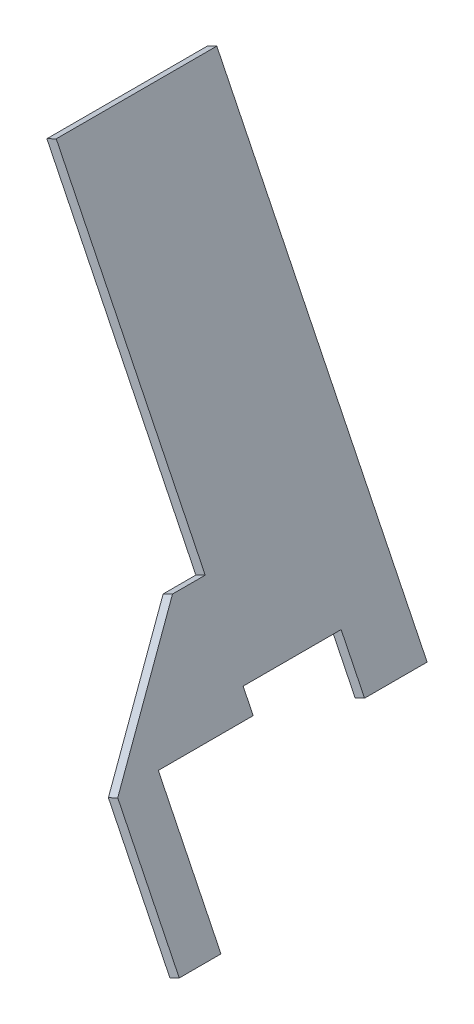
ISO-10303-21;
HEADER;
FILE_DESCRIPTION(('STEP AP214'),'2;1');
FILE_NAME('part.step','',(''),(''),'','','');
FILE_SCHEMA(('AUTOMOTIVE_DESIGN { 1 0 10303 214 1 1 1 1 }'));
ENDSEC;
DATA;
#1=APPLICATION_CONTEXT('core data for automotive mechanical design processes');
#2=APPLICATION_PROTOCOL_DEFINITION('international standard','automotive_design',2000,#1);
#3=PRODUCT_CONTEXT('',#1,'mechanical');
#4=PRODUCT('Part','Part','',(#3));
#5=PRODUCT_RELATED_PRODUCT_CATEGORY('part','',(#4));
#6=PRODUCT_DEFINITION_FORMATION('','',#4);
#7=PRODUCT_DEFINITION_CONTEXT('part definition',#1,'design');
#8=PRODUCT_DEFINITION('design','',#6,#7);
#9=PRODUCT_DEFINITION_SHAPE('','',#8);
#10=(LENGTH_UNIT() NAMED_UNIT(*) SI_UNIT(.MILLI.,.METRE.));
#11=(NAMED_UNIT(*) PLANE_ANGLE_UNIT() SI_UNIT($,.RADIAN.));
#12=(NAMED_UNIT(*) SI_UNIT($,.STERADIAN.) SOLID_ANGLE_UNIT());
#13=UNCERTAINTY_MEASURE_WITH_UNIT(LENGTH_MEASURE(1.E-05),#10,'distance_accuracy_value','');
#14=(GEOMETRIC_REPRESENTATION_CONTEXT(3) GLOBAL_UNCERTAINTY_ASSIGNED_CONTEXT((#13)) GLOBAL_UNIT_ASSIGNED_CONTEXT((#10,
#11,#12)) REPRESENTATION_CONTEXT('',''));
#15=CARTESIAN_POINT('',(0.,0.,0.));
#16=DIRECTION('',(0.,0.,1.));
#17=DIRECTION('',(1.,0.,0.));
#18=AXIS2_PLACEMENT_3D('',#15,#16,#17);
#19=CARTESIAN_POINT('',(-1087.59714977901,1460.59403878889,-167.509201475995));
#20=DIRECTION('',(-0.440786583584186,0.897611936045962,0.));
#21=DIRECTION('',(-0.897611936045963,-0.440786583584186,0.));
#22=AXIS2_PLACEMENT_3D('',#19,#20,#21);
#23=PLANE('',#22);
#24=DIRECTION('',(-0.897611936045989,-0.440786583584133,0.));
#25=VECTOR('',#24,1.);
#26=CARTESIAN_POINT('',(-1083.10909009879,1462.79797170682,69.7919402961655));
#27=LINE('',#26,#25);
#28=CARTESIAN_POINT('',(-1083.10909009878,1462.79797170681,69.7919402961655));
#29=VERTEX_POINT('',#28);
#30=CARTESIAN_POINT('',(-1087.59714977901,1460.59403878889,69.7919402961655));
#31=VERTEX_POINT('',#30);
#32=EDGE_CURVE('E48',#29,#31,#27,.T.);
#33=ORIENTED_EDGE('',*,*,#32,.F.);
#34=DIRECTION('',(0.,0.,1.));
#35=VECTOR('',#34,1.);
#36=CARTESIAN_POINT('',(-1083.10909009878,1462.79797170681,-167.509201475995));
#37=LINE('',#36,#35);
#38=CARTESIAN_POINT('',(-1083.10909009878,1462.79797170681,116.791940296161));
#39=VERTEX_POINT('',#38);
#40=EDGE_CURVE('E149',#29,#39,#37,.T.);
#41=ORIENTED_EDGE('',*,*,#40,.T.);
#42=DIRECTION('',(-0.897611936045962,-0.440786583584186,0.));
#43=VECTOR('',#42,1.);
#44=CARTESIAN_POINT('',(-1087.59714977901,1460.59403878889,116.791940296161));
#45=LINE('',#44,#43);
#46=CARTESIAN_POINT('',(-1087.59714977901,1460.59403878889,116.791940296161));
#47=VERTEX_POINT('',#46);
#48=EDGE_CURVE('E171',#39,#47,#45,.T.);
#49=ORIENTED_EDGE('',*,*,#48,.T.);
#50=DIRECTION('',(0.,0.,1.));
#51=VECTOR('',#50,1.);
#52=CARTESIAN_POINT('',(-1087.59714977901,1460.59403878889,-167.509201475995));
#53=LINE('',#52,#51);
#54=EDGE_CURVE('E53',#31,#47,#53,.T.);
#55=ORIENTED_EDGE('',*,*,#54,.F.);
#56=EDGE_LOOP('',(#33,#41,#49,#55));
#57=FACE_BOUND('',#56,.T.);
#58=ADVANCED_FACE('F33',(#57),#23,.F.);
#59=CARTESIAN_POINT('',(0.,0.,116.791940296161));
#60=DIRECTION('',(0.,0.,1.));
#61=DIRECTION('',(1.,0.,0.));
#62=AXIS2_PLACEMENT_3D('',#59,#60,#61);
#63=PLANE('',#62);
#64=ORIENTED_EDGE('',*,*,#48,.F.);
#65=DIRECTION('',(-0.440786583584171,0.89761193604597,0.));
#66=VECTOR('',#65,1.);
#67=CARTESIAN_POINT('',(-1173.16369118637,1646.18396357342,116.791940296161));
#68=LINE('',#67,#66);
#69=CARTESIAN_POINT('',(-1078.27752987886,1452.95904673804,116.791940296283));
#70=VERTEX_POINT('',#69);
#71=EDGE_CURVE('E219',#70,#39,#68,.T.);
#72=ORIENTED_EDGE('',*,*,#71,.F.);
#73=DIRECTION('',(0.897611936045971,0.44078658358417,0.));
#74=VECTOR('',#73,1.);
#75=CARTESIAN_POINT('',(-784.372519283686,1597.28576557512,116.791940296161));
#76=LINE('',#75,#74);
#77=CARTESIAN_POINT('',(-1082.7655895586,1450.75511382036,116.791940296283));
#78=VERTEX_POINT('',#77);
#79=EDGE_CURVE('E11',#78,#70,#76,.T.);
#80=ORIENTED_EDGE('',*,*,#79,.F.);
#81=DIRECTION('',(0.440786583586472,-0.89761193604484,0.));
#82=VECTOR('',#81,1.);
#83=CARTESIAN_POINT('',(-1177.6517508666,1643.9800306555,116.791940296161));
#84=LINE('',#83,#82);
#85=EDGE_CURVE('E218',#47,#78,#84,.T.);
#86=ORIENTED_EDGE('',*,*,#85,.F.);
#87=EDGE_LOOP('',(#64,#72,#80,#86));
#88=FACE_BOUND('',#87,.T.);
#89=ADVANCED_FACE('F247',(#88),#63,.F.);
#90=CARTESIAN_POINT('',(-1177.6517508666,1643.9800306555,628.751913537197));
#91=DIRECTION('',(0.89761193604484,0.440786583586472,0.));
#92=DIRECTION('',(-0.440786583586472,0.89761193604484,0.));
#93=AXIS2_PLACEMENT_3D('',#90,#91,#92);
#94=PLANE('',#93);
#95=DIRECTION('',(0.,0.,-1.));
#96=VECTOR('',#95,1.);
#97=CARTESIAN_POINT('',(-1082.7655895586,1450.75511382036,628.751913537197));
#98=LINE('',#97,#96);
#99=CARTESIAN_POINT('',(-1082.7655895586,1450.75511382036,162.291940296163));
#100=VERTEX_POINT('',#99);
#101=EDGE_CURVE('E207',#100,#78,#98,.T.);
#102=ORIENTED_EDGE('',*,*,#101,.F.);
#103=DIRECTION('',(-0.440786583586472,0.89761193604484,-1.45790381393275E-13));
#104=VECTOR('',#103,1.);
#105=CARTESIAN_POINT('',(-1177.65175086657,1643.98003065544,162.291940296132));
#106=LINE('',#105,#104);
#107=CARTESIAN_POINT('',(-1052.72331849906,1389.57743261799,162.291940296173));
#108=VERTEX_POINT('',#107);
#109=EDGE_CURVE('E210',#108,#100,#106,.T.);
#110=ORIENTED_EDGE('',*,*,#109,.F.);
#111=DIRECTION('',(0.,0.,-1.));
#112=VECTOR('',#111,1.);
#113=CARTESIAN_POINT('',(-1052.72331849906,1389.57743261799,628.751913537197));
#114=LINE('',#113,#112);
#115=CARTESIAN_POINT('',(-1052.72331849906,1389.57743261799,182.291940296173));
#116=VERTEX_POINT('',#115);
#117=EDGE_CURVE('E212',#116,#108,#114,.T.);
#118=ORIENTED_EDGE('',*,*,#117,.F.);
#119=DIRECTION('',(0.440786583586472,-0.89761193604484,1.48455241283847E-13));
#120=VECTOR('',#119,1.);
#121=CARTESIAN_POINT('',(-1177.65175086657,1643.98003065544,182.291940296131));
#122=LINE('',#121,#120);
#123=CARTESIAN_POINT('',(-1082.22631292225,1449.65693805085,182.291940296163));
#124=VERTEX_POINT('',#123);
#125=EDGE_CURVE('E214',#124,#116,#122,.T.);
#126=ORIENTED_EDGE('',*,*,#125,.F.);
#127=DIRECTION('',(0.322370899530032,-0.656471812043939,0.681998360062505));
#128=VECTOR('',#127,1.);
#129=CARTESIAN_POINT('',(-1035.11020938452,1353.71033148384,281.969378278655));
#130=LINE('',#129,#128);
#131=CARTESIAN_POINT('',(-1105.77192187012,1497.60490293919,132.479544969746));
#132=VERTEX_POINT('',#131);
#133=EDGE_CURVE('E216',#132,#124,#130,.T.);
#134=ORIENTED_EDGE('',*,*,#133,.F.);
#135=DIRECTION('',(0.,0.,1.));
#136=VECTOR('',#135,1.);
#137=CARTESIAN_POINT('',(-1105.77192187012,1497.60490293919,628.751913537197));
#138=LINE('',#137,#136);
#139=CARTESIAN_POINT('',(-1105.77192187012,1497.60490293919,116.791940296283));
#140=VERTEX_POINT('',#139);
#141=EDGE_CURVE('E205',#140,#132,#138,.T.);
#142=ORIENTED_EDGE('',*,*,#141,.F.);
#143=DIRECTION('',(-0.44078658358417,0.897611936045971,0.));
#144=VECTOR('',#143,1.);
#145=CARTESIAN_POINT('',(-1087.59714977901,1460.59403878889,116.791940296161));
#146=LINE('',#145,#144);
#147=CARTESIAN_POINT('',(-1177.21877990229,1643.09833434259,116.791940296161));
#148=VERTEX_POINT('',#147);
#149=EDGE_CURVE('E150',#140,#148,#146,.T.);
#150=ORIENTED_EDGE('',*,*,#149,.T.);
#151=DIRECTION('',(0.,0.,1.));
#152=VECTOR('',#151,1.);
#153=CARTESIAN_POINT('',(-1177.21877990229,1643.09833434259,-167.509201475995));
#154=LINE('',#153,#152);
#155=CARTESIAN_POINT('',(-1177.21877990229,1643.09833434259,39.7919402961635));
#156=VERTEX_POINT('',#155);
#157=EDGE_CURVE('E160',#156,#148,#154,.T.);
#158=ORIENTED_EDGE('',*,*,#157,.F.);
#159=DIRECTION('',(0.44078658358417,-0.897611936045971,0.));
#160=VECTOR('',#159,1.);
#161=CARTESIAN_POINT('',(-1087.59714977901,1460.59403878889,39.7919402961634));
#162=LINE('',#161,#160);
#163=CARTESIAN_POINT('',(-1076.35709189762,1437.70493441973,39.7919402961655));
#164=VERTEX_POINT('',#163);
#165=EDGE_CURVE('E163',#156,#164,#162,.T.);
#166=ORIENTED_EDGE('',*,*,#165,.T.);
#167=DIRECTION('',(0.,0.,-1.));
#168=VECTOR('',#167,1.);
#169=CARTESIAN_POINT('',(-1076.35709189762,1437.70493441973,69.7919402961655));
#170=LINE('',#169,#168);
#171=CARTESIAN_POINT('',(-1076.35709189762,1437.70493441973,69.7919402961655));
#172=VERTEX_POINT('',#171);
#173=EDGE_CURVE('E135',#172,#164,#170,.T.);
#174=ORIENTED_EDGE('',*,*,#173,.F.);
#175=DIRECTION('',(-0.440786583584143,0.897611936045984,0.));
#176=VECTOR('',#175,1.);
#177=CARTESIAN_POINT('',(-1076.35709189762,1437.70493441973,69.7919402961655));
#178=LINE('',#177,#176);
#179=EDGE_CURVE('E131',#172,#31,#178,.T.);
#180=ORIENTED_EDGE('',*,*,#179,.T.);
#181=ORIENTED_EDGE('',*,*,#54,.T.);
#182=ORIENTED_EDGE('',*,*,#85,.T.);
#183=EDGE_LOOP('',(#102,#110,#118,#126,#134,#142,#150,#158,#166,#174,#180,#181,#182));
#184=FACE_BOUND('',#183,.T.);
#185=ADVANCED_FACE('F35',(#184),#94,.F.);
#186=CARTESIAN_POINT('',(-1173.16369118637,1646.18396357342,628.751913537197));
#187=DIRECTION('',(-0.89761193604597,-0.440786583584171,0.));
#188=DIRECTION('',(0.440786583584171,-0.89761193604597,0.));
#189=AXIS2_PLACEMENT_3D('',#186,#187,#188);
#190=PLANE('',#189);
#191=DIRECTION('',(0.,0.,-1.));
#192=VECTOR('',#191,1.);
#193=CARTESIAN_POINT('',(-1078.27752987886,1452.95904673804,116.791940296283));
#194=LINE('',#193,#192);
#195=CARTESIAN_POINT('',(-1078.27752987886,1452.95904673804,162.291940296163));
#196=VERTEX_POINT('',#195);
#197=EDGE_CURVE('E190',#196,#70,#194,.T.);
#198=ORIENTED_EDGE('',*,*,#197,.T.);
#199=ORIENTED_EDGE('',*,*,#71,.T.);
#200=ORIENTED_EDGE('',*,*,#40,.F.);
#201=DIRECTION('',(-0.440786583584143,0.897611936045984,0.));
#202=VECTOR('',#201,1.);
#203=CARTESIAN_POINT('',(-1071.86903221739,1439.90886733765,69.7919402961655));
#204=LINE('',#203,#202);
#205=CARTESIAN_POINT('',(-1071.86903221739,1439.90886733765,69.7919402961655));
#206=VERTEX_POINT('',#205);
#207=EDGE_CURVE('E129',#206,#29,#204,.T.);
#208=ORIENTED_EDGE('',*,*,#207,.F.);
#209=DIRECTION('',(0.,0.,1.));
#210=VECTOR('',#209,1.);
#211=CARTESIAN_POINT('',(-1071.86903221739,1439.90886733765,69.7919402961655));
#212=LINE('',#211,#210);
#213=CARTESIAN_POINT('',(-1071.86903221739,1439.90886733765,39.7919402961655));
#214=VERTEX_POINT('',#213);
#215=EDGE_CURVE('E136',#214,#206,#212,.T.);
#216=ORIENTED_EDGE('',*,*,#215,.F.);
#217=DIRECTION('',(-0.44078658358417,0.897611936045971,0.));
#218=VECTOR('',#217,1.);
#219=CARTESIAN_POINT('',(-1083.10909009878,1462.79797170681,39.7919402961634));
#220=LINE('',#219,#218);
#221=CARTESIAN_POINT('',(-1172.73072022206,1645.30226726051,39.7919402961635));
#222=VERTEX_POINT('',#221);
#223=EDGE_CURVE('E157',#214,#222,#220,.T.);
#224=ORIENTED_EDGE('',*,*,#223,.T.);
#225=DIRECTION('',(0.,0.,1.));
#226=VECTOR('',#225,1.);
#227=CARTESIAN_POINT('',(-1172.73072022206,1645.30226726051,-167.509201475995));
#228=LINE('',#227,#226);
#229=CARTESIAN_POINT('',(-1172.73072022206,1645.30226726051,116.791940296161));
#230=VERTEX_POINT('',#229);
#231=EDGE_CURVE('E175',#222,#230,#228,.T.);
#232=ORIENTED_EDGE('',*,*,#231,.T.);
#233=DIRECTION('',(0.44078658358417,-0.897611936045971,0.));
#234=VECTOR('',#233,1.);
#235=CARTESIAN_POINT('',(-1083.10909009878,1462.79797170681,116.791940296161));
#236=LINE('',#235,#234);
#237=CARTESIAN_POINT('',(-1101.28386219027,1499.80883585693,116.791940296161));
#238=VERTEX_POINT('',#237);
#239=EDGE_CURVE('E168',#230,#238,#236,.T.);
#240=ORIENTED_EDGE('',*,*,#239,.T.);
#241=DIRECTION('',(0.,0.,1.));
#242=VECTOR('',#241,1.);
#243=CARTESIAN_POINT('',(-1101.28386219027,1499.80883585693,132.479544969746));
#244=LINE('',#243,#242);
#245=CARTESIAN_POINT('',(-1101.28386219027,1499.80883585693,132.479544969746));
#246=VERTEX_POINT('',#245);
#247=EDGE_CURVE('E192',#238,#246,#244,.T.);
#248=ORIENTED_EDGE('',*,*,#247,.T.);
#249=DIRECTION('',(0.322370899528347,-0.656471812044766,0.681998360062505));
#250=VECTOR('',#249,1.);
#251=CARTESIAN_POINT('',(-1101.28386219027,1499.80883585693,132.479544969746));
#252=LINE('',#251,#250);
#253=CARTESIAN_POINT('',(-1077.73825324251,1451.86087096853,182.291940296163));
#254=VERTEX_POINT('',#253);
#255=EDGE_CURVE('E164',#246,#254,#252,.T.);
#256=ORIENTED_EDGE('',*,*,#255,.T.);
#257=DIRECTION('',(0.440786583584169,-0.897611936045971,1.48455241283846E-13));
#258=VECTOR('',#257,1.);
#259=CARTESIAN_POINT('',(-1048.23525881948,1391.78136553559,182.291940296173));
#260=LINE('',#259,#258);
#261=CARTESIAN_POINT('',(-1048.23525881948,1391.78136553559,182.291940296173));
#262=VERTEX_POINT('',#261);
#263=EDGE_CURVE('E181',#254,#262,#260,.T.);
#264=ORIENTED_EDGE('',*,*,#263,.T.);
#265=DIRECTION('',(0.,0.,-1.));
#266=VECTOR('',#265,1.);
#267=CARTESIAN_POINT('',(-1048.23525881948,1391.78136553559,162.291940296173));
#268=LINE('',#267,#266);
#269=CARTESIAN_POINT('',(-1048.23525881948,1391.78136553559,162.291940296173));
#270=VERTEX_POINT('',#269);
#271=EDGE_CURVE('E184',#262,#270,#268,.T.);
#272=ORIENTED_EDGE('',*,*,#271,.T.);
#273=DIRECTION('',(-0.440786583584168,0.897611936045971,-1.45790381393275E-13));
#274=VECTOR('',#273,1.);
#275=CARTESIAN_POINT('',(-1078.27752987886,1452.95904673804,162.291940296163));
#276=LINE('',#275,#274);
#277=EDGE_CURVE('E187',#270,#196,#276,.T.);
#278=ORIENTED_EDGE('',*,*,#277,.T.);
#279=EDGE_LOOP('',(#198,#199,#200,#208,#216,#224,#232,#240,#248,#256,#264,#272,#278));
#280=FACE_BOUND('',#279,.T.);
#281=ADVANCED_FACE('F147',(#280),#190,.F.);
#282=CARTESIAN_POINT('',(-1211.49575728607,1445.68753604042,132.479544969746));
#283=DIRECTION('',(-0.300615727141958,0.612169868355882,0.731353701619165));
#284=DIRECTION('',(0.,-0.766822826298447,0.641858826431219));
#285=AXIS2_PLACEMENT_3D('',#282,#283,#284);
#286=PLANE('',#285);
#287=ORIENTED_EDGE('',*,*,#133,.T.);
#288=DIRECTION('',(0.897611936045971,0.44078658358417,0.));
#289=VECTOR('',#288,1.);
#290=CARTESIAN_POINT('',(-1187.95014833832,1397.73957115202,182.291940296163));
#291=LINE('',#290,#289);
#292=EDGE_CURVE('E203',#124,#254,#291,.T.);
#293=ORIENTED_EDGE('',*,*,#292,.T.);
#294=ORIENTED_EDGE('',*,*,#255,.F.);
#295=DIRECTION('',(0.897611936045971,0.44078658358417,0.));
#296=VECTOR('',#295,1.);
#297=CARTESIAN_POINT('',(-1211.49575728607,1445.68753604042,132.479544969746));
#298=LINE('',#297,#296);
#299=EDGE_CURVE('E195',#132,#246,#298,.T.);
#300=ORIENTED_EDGE('',*,*,#299,.F.);
#301=EDGE_LOOP('',(#287,#293,#294,#300));
#302=FACE_BOUND('',#301,.T.);
#303=ADVANCED_FACE('F277',(#302),#286,.T.);
#304=CARTESIAN_POINT('',(-1158.44715391529,1337.66006571909,182.291940296173));
#305=DIRECTION('',(0.,1.33200773771221E-13,1.));
#306=DIRECTION('',(0.,-1.,1.33200773771221E-13));
#307=AXIS2_PLACEMENT_3D('',#304,#305,#306);
#308=PLANE('',#307);
#309=ORIENTED_EDGE('',*,*,#125,.T.);
#310=DIRECTION('',(0.897611936045971,0.44078658358417,0.));
#311=VECTOR('',#310,1.);
#312=CARTESIAN_POINT('',(-1158.44715391529,1337.66006571909,182.291940296173));
#313=LINE('',#312,#311);
#314=EDGE_CURVE('E201',#116,#262,#313,.T.);
#315=ORIENTED_EDGE('',*,*,#314,.T.);
#316=ORIENTED_EDGE('',*,*,#263,.F.);
#317=ORIENTED_EDGE('',*,*,#292,.F.);
#318=EDGE_LOOP('',(#309,#315,#316,#317));
#319=FACE_BOUND('',#318,.T.);
#320=ADVANCED_FACE('F273',(#319),#308,.T.);
#321=CARTESIAN_POINT('',(-1158.44715391529,1337.66006571909,162.291940296173));
#322=DIRECTION('',(0.44078658358417,-0.897611936045971,0.));
#323=DIRECTION('',(0.89761193604597,0.44078658358417,0.));
#324=AXIS2_PLACEMENT_3D('',#321,#322,#323);
#325=PLANE('',#324);
#326=ORIENTED_EDGE('',*,*,#117,.T.);
#327=DIRECTION('',(0.897611936045971,0.44078658358417,0.));
#328=VECTOR('',#327,1.);
#329=CARTESIAN_POINT('',(-1158.44715391529,1337.66006571909,162.291940296173));
#330=LINE('',#329,#328);
#331=EDGE_CURVE('E199',#108,#270,#330,.T.);
#332=ORIENTED_EDGE('',*,*,#331,.T.);
#333=ORIENTED_EDGE('',*,*,#271,.F.);
#334=ORIENTED_EDGE('',*,*,#314,.F.);
#335=EDGE_LOOP('',(#326,#332,#333,#334));
#336=FACE_BOUND('',#335,.T.);
#337=ADVANCED_FACE('F269',(#336),#325,.T.);
#338=CARTESIAN_POINT('',(-1188.48942497467,1398.83774692153,162.291940296163));
#339=DIRECTION('',(0.,-1.30808763725554E-13,-1.));
#340=DIRECTION('',(0.,1.,-1.30808763725554E-13));
#341=AXIS2_PLACEMENT_3D('',#338,#339,#340);
#342=PLANE('',#341);
#343=ORIENTED_EDGE('',*,*,#109,.T.);
#344=DIRECTION('',(0.897611936045971,0.44078658358417,0.));
#345=VECTOR('',#344,1.);
#346=CARTESIAN_POINT('',(-1188.48942497467,1398.83774692153,162.291940296163));
#347=LINE('',#346,#345);
#348=EDGE_CURVE('E197',#100,#196,#347,.T.);
#349=ORIENTED_EDGE('',*,*,#348,.T.);
#350=ORIENTED_EDGE('',*,*,#277,.F.);
#351=ORIENTED_EDGE('',*,*,#331,.F.);
#352=EDGE_LOOP('',(#343,#349,#350,#351));
#353=FACE_BOUND('',#352,.T.);
#354=ADVANCED_FACE('F265',(#353),#342,.T.);
#355=CARTESIAN_POINT('',(-1188.48942497467,1398.83774692153,116.791940296283));
#356=DIRECTION('',(0.44078658358417,-0.897611936045971,0.));
#357=DIRECTION('',(0.897611936045971,0.44078658358417,0.));
#358=AXIS2_PLACEMENT_3D('',#355,#356,#357);
#359=PLANE('',#358);
#360=ORIENTED_EDGE('',*,*,#101,.T.);
#361=ORIENTED_EDGE('',*,*,#79,.T.);
#362=ORIENTED_EDGE('',*,*,#197,.F.);
#363=ORIENTED_EDGE('',*,*,#348,.F.);
#364=EDGE_LOOP('',(#360,#361,#362,#363));
#365=FACE_BOUND('',#364,.T.);
#366=ADVANCED_FACE('F262',(#365),#359,.T.);
#367=CARTESIAN_POINT('',(-1211.49575728607,1445.68753604042,132.479544969746));
#368=DIRECTION('',(-0.44078658358417,0.897611936045971,0.));
#369=DIRECTION('',(-0.89761193604597,-0.44078658358417,0.));
#370=AXIS2_PLACEMENT_3D('',#367,#368,#369);
#371=PLANE('',#370);
#372=ORIENTED_EDGE('',*,*,#141,.T.);
#373=ORIENTED_EDGE('',*,*,#299,.T.);
#374=ORIENTED_EDGE('',*,*,#247,.F.);
#375=DIRECTION('',(-0.89761193604597,-0.44078658358417,0.));
#376=VECTOR('',#375,1.);
#377=CARTESIAN_POINT('',(-807.378851595088,1644.13555469401,116.791940296161));
#378=LINE('',#377,#376);
#379=EDGE_CURVE('E41',#238,#140,#378,.T.);
#380=ORIENTED_EDGE('',*,*,#379,.T.);
#381=EDGE_LOOP('',(#372,#373,#374,#380));
#382=FACE_BOUND('',#381,.T.);
#383=ADVANCED_FACE('F224',(#382),#371,.T.);
#384=CARTESIAN_POINT('',(0.,0.,116.791940296161));
#385=DIRECTION('',(0.,0.,-1.));
#386=DIRECTION('',(-1.,0.,0.));
#387=AXIS2_PLACEMENT_3D('',#384,#385,#386);
#388=PLANE('',#387);
#389=ORIENTED_EDGE('',*,*,#379,.F.);
#390=ORIENTED_EDGE('',*,*,#239,.F.);
#391=DIRECTION('',(0.897611936045962,0.440786583584186,0.));
#392=VECTOR('',#391,1.);
#393=CARTESIAN_POINT('',(-1177.21877990229,1643.09833434259,116.791940296161));
#394=LINE('',#393,#392);
#395=EDGE_CURVE('E152',#148,#230,#394,.T.);
#396=ORIENTED_EDGE('',*,*,#395,.F.);
#397=ORIENTED_EDGE('',*,*,#149,.F.);
#398=EDGE_LOOP('',(#389,#390,#396,#397));
#399=FACE_BOUND('',#398,.T.);
#400=ADVANCED_FACE('F235',(#399),#388,.F.);
#401=CARTESIAN_POINT('',(-1177.21877990229,1643.09833434259,-167.509201475995));
#402=DIRECTION('',(0.440786583584186,-0.897611936045962,0.));
#403=DIRECTION('',(0.897611936045963,0.440786583584186,0.));
#404=AXIS2_PLACEMENT_3D('',#401,#402,#403);
#405=PLANE('',#404);
#406=ORIENTED_EDGE('',*,*,#231,.F.);
#407=DIRECTION('',(-0.897611936045963,-0.440786583584186,0.));
#408=VECTOR('',#407,1.);
#409=CARTESIAN_POINT('',(-1177.21877990229,1643.09833434259,39.7919402961635));
#410=LINE('',#409,#408);
#411=EDGE_CURVE('E159',#222,#156,#410,.T.);
#412=ORIENTED_EDGE('',*,*,#411,.T.);
#413=ORIENTED_EDGE('',*,*,#157,.T.);
#414=ORIENTED_EDGE('',*,*,#395,.T.);
#415=EDGE_LOOP('',(#406,#412,#413,#414));
#416=FACE_BOUND('',#415,.T.);
#417=ADVANCED_FACE('F238',(#416),#405,.F.);
#418=CARTESIAN_POINT('',(-1085.76976383406,1286.447622247,39.7919402961634));
#419=DIRECTION('',(0.,0.,1.));
#420=DIRECTION('',(-0.895373922509721,0.445315100675417,0.));
#421=AXIS2_PLACEMENT_3D('',#418,#419,#420);
#422=PLANE('',#421);
#423=ORIENTED_EDGE('',*,*,#411,.F.);
#424=ORIENTED_EDGE('',*,*,#223,.F.);
#425=DIRECTION('',(0.897611936045989,0.440786583584133,0.));
#426=VECTOR('',#425,1.);
#427=CARTESIAN_POINT('',(-1071.86903221739,1439.90886733765,39.7919402961655));
#428=LINE('',#427,#426);
#429=EDGE_CURVE('E142',#164,#214,#428,.T.);
#430=ORIENTED_EDGE('',*,*,#429,.F.);
#431=ORIENTED_EDGE('',*,*,#165,.F.);
#432=EDGE_LOOP('',(#423,#424,#430,#431));
#433=FACE_BOUND('',#432,.T.);
#434=ADVANCED_FACE('F241',(#433),#422,.F.);
#435=CARTESIAN_POINT('',(-1071.86903221739,1439.90886733765,69.7919402961655));
#436=DIRECTION('',(0.,0.,-1.));
#437=DIRECTION('',(-1.,0.,0.));
#438=AXIS2_PLACEMENT_3D('',#435,#436,#437);
#439=PLANE('',#438);
#440=ORIENTED_EDGE('',*,*,#32,.T.);
#441=ORIENTED_EDGE('',*,*,#179,.F.);
#442=DIRECTION('',(-0.897611936045989,-0.440786583584133,0.));
#443=VECTOR('',#442,1.);
#444=CARTESIAN_POINT('',(-1071.86903221739,1439.90886733765,69.7919402961655));
#445=LINE('',#444,#443);
#446=EDGE_CURVE('E125',#206,#172,#445,.T.);
#447=ORIENTED_EDGE('',*,*,#446,.F.);
#448=ORIENTED_EDGE('',*,*,#207,.T.);
#449=EDGE_LOOP('',(#440,#441,#447,#448));
#450=FACE_BOUND('',#449,.T.);
#451=ADVANCED_FACE('F127',(#450),#439,.F.);
#452=CARTESIAN_POINT('',(-777.964021622144,1584.23558617475,0.));
#453=DIRECTION('',(-0.440786583584133,0.897611936045989,0.));
#454=DIRECTION('',(-0.897611936045989,-0.440786583584133,0.));
#455=AXIS2_PLACEMENT_3D('',#452,#453,#454);
#456=PLANE('',#455);
#457=ORIENTED_EDGE('',*,*,#215,.T.);
#458=ORIENTED_EDGE('',*,*,#446,.T.);
#459=ORIENTED_EDGE('',*,*,#173,.T.);
#460=ORIENTED_EDGE('',*,*,#429,.T.);
#461=EDGE_LOOP('',(#457,#458,#459,#460));
#462=FACE_BOUND('',#461,.T.);
#463=ADVANCED_FACE('F140',(#462),#456,.F.);
#464=CLOSED_SHELL('',(#58,#89,#185,#281,#303,#320,#337,#354,#366,#383,#400,#417,#434,#451,#463));
#465=MANIFOLD_SOLID_BREP('B2',#464);
#466=ADVANCED_BREP_SHAPE_REPRESENTATION('',(#18,#465),#14);
#467=SHAPE_DEFINITION_REPRESENTATION(#9,#466);
ENDSEC;
END-ISO-10303-21;
